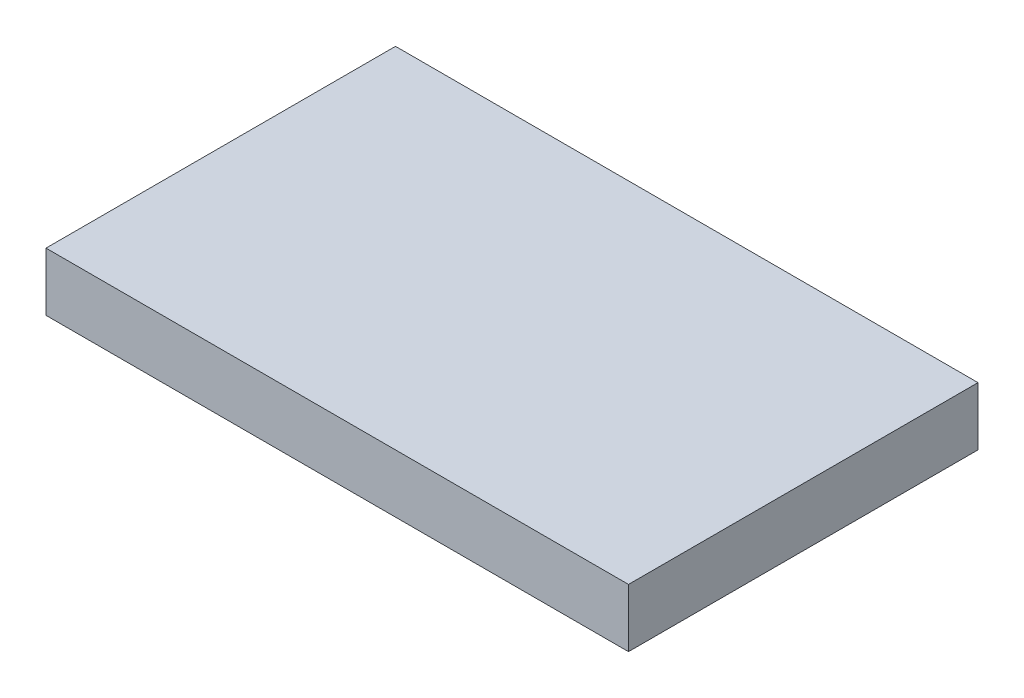
ISO-10303-21;
HEADER;
FILE_DESCRIPTION(('STEP AP214'),'2;1');
FILE_NAME('part.step','',(''),(''),'','','');
FILE_SCHEMA(('AUTOMOTIVE_DESIGN { 1 0 10303 214 1 1 1 1 }'));
ENDSEC;
DATA;
#1=APPLICATION_CONTEXT('core data for automotive mechanical design processes');
#2=APPLICATION_PROTOCOL_DEFINITION('international standard','automotive_design',2000,#1);
#3=PRODUCT_CONTEXT('',#1,'mechanical');
#4=PRODUCT('Part','Part','',(#3));
#5=PRODUCT_RELATED_PRODUCT_CATEGORY('part','',(#4));
#6=PRODUCT_DEFINITION_FORMATION('','',#4);
#7=PRODUCT_DEFINITION_CONTEXT('part definition',#1,'design');
#8=PRODUCT_DEFINITION('design','',#6,#7);
#9=PRODUCT_DEFINITION_SHAPE('','',#8);
#10=(LENGTH_UNIT() NAMED_UNIT(*) SI_UNIT(.MILLI.,.METRE.));
#11=(NAMED_UNIT(*) PLANE_ANGLE_UNIT() SI_UNIT($,.RADIAN.));
#12=(NAMED_UNIT(*) SI_UNIT($,.STERADIAN.) SOLID_ANGLE_UNIT());
#13=UNCERTAINTY_MEASURE_WITH_UNIT(LENGTH_MEASURE(1.E-05),#10,'distance_accuracy_value','');
#14=(GEOMETRIC_REPRESENTATION_CONTEXT(3) GLOBAL_UNCERTAINTY_ASSIGNED_CONTEXT((#13)) GLOBAL_UNIT_ASSIGNED_CONTEXT((#10,
#11,#12)) REPRESENTATION_CONTEXT('',''));
#15=CARTESIAN_POINT('',(0.,0.,0.));
#16=DIRECTION('',(0.,0.,1.));
#17=DIRECTION('',(1.,0.,0.));
#18=AXIS2_PLACEMENT_3D('',#15,#16,#17);
#19=CARTESIAN_POINT('',(0.,4.7625,0.));
#20=DIRECTION('',(1.,0.,0.));
#21=DIRECTION('',(0.,0.,-1.));
#22=AXIS2_PLACEMENT_3D('',#19,#20,#21);
#23=PLANE('',#22);
#24=DIRECTION('',(0.,0.,1.));
#25=VECTOR('',#24,1.);
#26=CARTESIAN_POINT('',(0.,0.,0.));
#27=LINE('',#26,#25);
#28=CARTESIAN_POINT('',(0.,0.,0.));
#29=VERTEX_POINT('',#28);
#30=CARTESIAN_POINT('',(0.,0.,28.575));
#31=VERTEX_POINT('',#30);
#32=EDGE_CURVE('E99',#29,#31,#27,.T.);
#33=ORIENTED_EDGE('',*,*,#32,.T.);
#34=DIRECTION('',(0.,-1.,0.));
#35=VECTOR('',#34,1.);
#36=CARTESIAN_POINT('',(0.,4.7625,28.575));
#37=LINE('',#36,#35);
#38=CARTESIAN_POINT('',(0.,4.7625,28.575));
#39=VERTEX_POINT('',#38);
#40=EDGE_CURVE('E11',#39,#31,#37,.T.);
#41=ORIENTED_EDGE('',*,*,#40,.F.);
#42=DIRECTION('',(0.,0.,1.));
#43=VECTOR('',#42,1.);
#44=CARTESIAN_POINT('',(0.,4.7625,0.));
#45=LINE('',#44,#43);
#46=CARTESIAN_POINT('',(0.,4.7625,0.));
#47=VERTEX_POINT('',#46);
#48=EDGE_CURVE('E87',#47,#39,#45,.T.);
#49=ORIENTED_EDGE('',*,*,#48,.F.);
#50=DIRECTION('',(0.,-1.,0.));
#51=VECTOR('',#50,1.);
#52=CARTESIAN_POINT('',(0.,4.7625,0.));
#53=LINE('',#52,#51);
#54=EDGE_CURVE('E95',#47,#29,#53,.T.);
#55=ORIENTED_EDGE('',*,*,#54,.T.);
#56=EDGE_LOOP('',(#33,#41,#49,#55));
#57=FACE_BOUND('',#56,.T.);
#58=ADVANCED_FACE('F36',(#57),#23,.F.);
#59=CARTESIAN_POINT('',(0.,4.7625,28.575));
#60=DIRECTION('',(0.,0.,-1.));
#61=DIRECTION('',(-1.,0.,0.));
#62=AXIS2_PLACEMENT_3D('',#59,#60,#61);
#63=PLANE('',#62);
#64=DIRECTION('',(1.,0.,0.));
#65=VECTOR('',#64,1.);
#66=CARTESIAN_POINT('',(0.,0.,28.575));
#67=LINE('',#66,#65);
#68=CARTESIAN_POINT('',(47.625,0.,28.575));
#69=VERTEX_POINT('',#68);
#70=EDGE_CURVE('E91',#31,#69,#67,.T.);
#71=ORIENTED_EDGE('',*,*,#70,.T.);
#72=DIRECTION('',(0.,-1.,0.));
#73=VECTOR('',#72,1.);
#74=CARTESIAN_POINT('',(47.625,4.7625,28.575));
#75=LINE('',#74,#73);
#76=CARTESIAN_POINT('',(47.625,4.7625,28.575));
#77=VERTEX_POINT('',#76);
#78=EDGE_CURVE('E44',#77,#69,#75,.T.);
#79=ORIENTED_EDGE('',*,*,#78,.F.);
#80=DIRECTION('',(1.,0.,0.));
#81=VECTOR('',#80,1.);
#82=CARTESIAN_POINT('',(0.,4.7625,28.575));
#83=LINE('',#82,#81);
#84=EDGE_CURVE('E82',#39,#77,#83,.T.);
#85=ORIENTED_EDGE('',*,*,#84,.F.);
#86=ORIENTED_EDGE('',*,*,#40,.T.);
#87=EDGE_LOOP('',(#71,#79,#85,#86));
#88=FACE_BOUND('',#87,.T.);
#89=ADVANCED_FACE('F90',(#88),#63,.F.);
#90=CARTESIAN_POINT('',(47.625,4.7625,0.));
#91=DIRECTION('',(-1.,0.,0.));
#92=DIRECTION('',(0.,0.,1.));
#93=AXIS2_PLACEMENT_3D('',#90,#91,#92);
#94=PLANE('',#93);
#95=DIRECTION('',(0.,0.,-1.));
#96=VECTOR('',#95,1.);
#97=CARTESIAN_POINT('',(47.625,0.,0.));
#98=LINE('',#97,#96);
#99=CARTESIAN_POINT('',(47.625,0.,0.));
#100=VERTEX_POINT('',#99);
#101=EDGE_CURVE('E69',#69,#100,#98,.T.);
#102=ORIENTED_EDGE('',*,*,#101,.T.);
#103=DIRECTION('',(0.,-1.,0.));
#104=VECTOR('',#103,1.);
#105=CARTESIAN_POINT('',(47.625,4.7625,0.));
#106=LINE('',#105,#104);
#107=CARTESIAN_POINT('',(47.625,4.7625,0.));
#108=VERTEX_POINT('',#107);
#109=EDGE_CURVE('E92',#108,#100,#106,.T.);
#110=ORIENTED_EDGE('',*,*,#109,.F.);
#111=DIRECTION('',(0.,0.,-1.));
#112=VECTOR('',#111,1.);
#113=CARTESIAN_POINT('',(47.625,4.7625,0.));
#114=LINE('',#113,#112);
#115=EDGE_CURVE('E85',#77,#108,#114,.T.);
#116=ORIENTED_EDGE('',*,*,#115,.F.);
#117=ORIENTED_EDGE('',*,*,#78,.T.);
#118=EDGE_LOOP('',(#102,#110,#116,#117));
#119=FACE_BOUND('',#118,.T.);
#120=ADVANCED_FACE('F93',(#119),#94,.F.);
#121=CARTESIAN_POINT('',(0.,4.7625,0.));
#122=DIRECTION('',(0.,0.,1.));
#123=DIRECTION('',(1.,0.,0.));
#124=AXIS2_PLACEMENT_3D('',#121,#122,#123);
#125=PLANE('',#124);
#126=DIRECTION('',(-1.,0.,0.));
#127=VECTOR('',#126,1.);
#128=CARTESIAN_POINT('',(0.,0.,0.));
#129=LINE('',#128,#127);
#130=EDGE_CURVE('E75',#100,#29,#129,.T.);
#131=ORIENTED_EDGE('',*,*,#130,.T.);
#132=ORIENTED_EDGE('',*,*,#54,.F.);
#133=DIRECTION('',(-1.,0.,0.));
#134=VECTOR('',#133,1.);
#135=CARTESIAN_POINT('',(0.,4.7625,0.));
#136=LINE('',#135,#134);
#137=EDGE_CURVE('E52',#108,#47,#136,.T.);
#138=ORIENTED_EDGE('',*,*,#137,.F.);
#139=ORIENTED_EDGE('',*,*,#109,.T.);
#140=EDGE_LOOP('',(#131,#132,#138,#139));
#141=FACE_BOUND('',#140,.T.);
#142=ADVANCED_FACE('F106',(#141),#125,.F.);
#143=CARTESIAN_POINT('',(0.,4.7625,0.));
#144=DIRECTION('',(0.,1.,0.));
#145=DIRECTION('',(0.,0.,1.));
#146=AXIS2_PLACEMENT_3D('',#143,#144,#145);
#147=PLANE('',#146);
#148=ORIENTED_EDGE('',*,*,#48,.T.);
#149=ORIENTED_EDGE('',*,*,#84,.T.);
#150=ORIENTED_EDGE('',*,*,#115,.T.);
#151=ORIENTED_EDGE('',*,*,#137,.T.);
#152=EDGE_LOOP('',(#148,#149,#150,#151));
#153=FACE_BOUND('',#152,.T.);
#154=ADVANCED_FACE('F83',(#153),#147,.T.);
#155=CARTESIAN_POINT('',(0.,0.,0.));
#156=DIRECTION('',(0.,1.,0.));
#157=DIRECTION('',(0.,0.,1.));
#158=AXIS2_PLACEMENT_3D('',#155,#156,#157);
#159=PLANE('',#158);
#160=ORIENTED_EDGE('',*,*,#32,.F.);
#161=ORIENTED_EDGE('',*,*,#130,.F.);
#162=ORIENTED_EDGE('',*,*,#101,.F.);
#163=ORIENTED_EDGE('',*,*,#70,.F.);
#164=EDGE_LOOP('',(#160,#161,#162,#163));
#165=FACE_BOUND('',#164,.T.);
#166=ADVANCED_FACE('F109',(#165),#159,.F.);
#167=CLOSED_SHELL('',(#58,#89,#120,#142,#154,#166));
#168=MANIFOLD_SOLID_BREP('B2',#167);
#169=ADVANCED_BREP_SHAPE_REPRESENTATION('',(#18,#168),#14);
#170=SHAPE_DEFINITION_REPRESENTATION(#9,#169);
ENDSEC;
END-ISO-10303-21;
